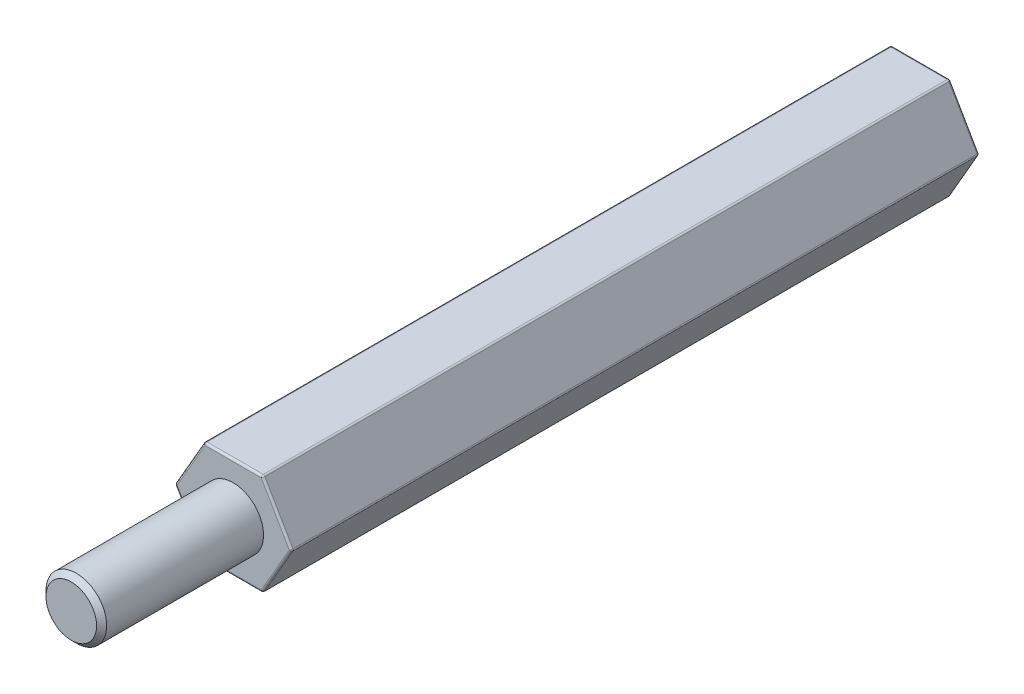
ISO-10303-21;
HEADER;
FILE_DESCRIPTION(('STEP AP214'),'2;1');
FILE_NAME('part.step','',(''),(''),'','','');
FILE_SCHEMA(('AUTOMOTIVE_DESIGN { 1 0 10303 214 1 1 1 1 }'));
ENDSEC;
DATA;
#1=APPLICATION_CONTEXT('core data for automotive mechanical design processes');
#2=APPLICATION_PROTOCOL_DEFINITION('international standard','automotive_design',2000,#1);
#3=PRODUCT_CONTEXT('',#1,'mechanical');
#4=PRODUCT('Part','Part','',(#3));
#5=PRODUCT_RELATED_PRODUCT_CATEGORY('part','',(#4));
#6=PRODUCT_DEFINITION_FORMATION('','',#4);
#7=PRODUCT_DEFINITION_CONTEXT('part definition',#1,'design');
#8=PRODUCT_DEFINITION('design','',#6,#7);
#9=PRODUCT_DEFINITION_SHAPE('','',#8);
#10=(LENGTH_UNIT() NAMED_UNIT(*) SI_UNIT(.MILLI.,.METRE.));
#11=(NAMED_UNIT(*) PLANE_ANGLE_UNIT() SI_UNIT($,.RADIAN.));
#12=(NAMED_UNIT(*) SI_UNIT($,.STERADIAN.) SOLID_ANGLE_UNIT());
#13=UNCERTAINTY_MEASURE_WITH_UNIT(LENGTH_MEASURE(1.E-05),#10,'distance_accuracy_value','');
#14=(GEOMETRIC_REPRESENTATION_CONTEXT(3) GLOBAL_UNCERTAINTY_ASSIGNED_CONTEXT((#13)) GLOBAL_UNIT_ASSIGNED_CONTEXT((#10,
#11,#12)) REPRESENTATION_CONTEXT('',''));
#15=CARTESIAN_POINT('',(0.,0.,0.));
#16=DIRECTION('',(0.,0.,1.));
#17=DIRECTION('',(1.,0.,0.));
#18=AXIS2_PLACEMENT_3D('',#15,#16,#17);
#19=CARTESIAN_POINT('',(0.,0.,8.));
#20=DIRECTION('',(0.,0.,-1.));
#21=DIRECTION('',(-1.,0.,0.));
#22=AXIS2_PLACEMENT_3D('',#19,#20,#21);
#23=CYLINDRICAL_SURFACE('',#22,1.5);
#24=CARTESIAN_POINT('',(0.,0.,7.75));
#25=DIRECTION('',(0.,0.,1.));
#26=DIRECTION('',(1.,0.,0.));
#27=AXIS2_PLACEMENT_3D('',#24,#25,#26);
#28=CIRCLE('',#27,1.5);
#29=CARTESIAN_POINT('',(1.5,0.,7.75));
#30=VERTEX_POINT('',#29);
#31=EDGE_CURVE('E189',#30,#30,#28,.F.);
#32=ORIENTED_EDGE('',*,*,#31,.T.);
#33=EDGE_LOOP('',(#32));
#34=FACE_BOUND('',#33,.T.);
#35=CARTESIAN_POINT('',(0.,0.,0.));
#36=DIRECTION('',(0.,0.,-1.));
#37=DIRECTION('',(-1.,0.,0.));
#38=AXIS2_PLACEMENT_3D('',#35,#36,#37);
#39=CIRCLE('',#38,1.5);
#40=CARTESIAN_POINT('',(-1.5,0.,0.));
#41=VERTEX_POINT('',#40);
#42=EDGE_CURVE('E173',#41,#41,#39,.T.);
#43=ORIENTED_EDGE('',*,*,#42,.F.);
#44=EDGE_LOOP('',(#43));
#45=FACE_BOUND('',#44,.T.);
#46=ADVANCED_FACE('F37',(#34,#45),#23,.T.);
#47=CARTESIAN_POINT('',(0.,0.,8.));
#48=DIRECTION('',(0.,0.,1.));
#49=DIRECTION('',(1.,0.,0.));
#50=AXIS2_PLACEMENT_3D('',#47,#48,#49);
#51=PLANE('',#50);
#52=CARTESIAN_POINT('',(0.,0.,8.));
#53=DIRECTION('',(0.,0.,1.));
#54=DIRECTION('',(1.,0.,0.));
#55=AXIS2_PLACEMENT_3D('',#52,#53,#54);
#56=CIRCLE('',#55,1.25);
#57=CARTESIAN_POINT('',(1.25,0.,8.));
#58=VERTEX_POINT('',#57);
#59=EDGE_CURVE('E186',#58,#58,#56,.T.);
#60=ORIENTED_EDGE('',*,*,#59,.T.);
#61=EDGE_LOOP('',(#60));
#62=FACE_BOUND('',#61,.T.);
#63=ADVANCED_FACE('F477',(#62),#51,.T.);
#64=CARTESIAN_POINT('',(-2.88675134594813,0.,0.));
#65=DIRECTION('',(0.,0.,-1.));
#66=DIRECTION('',(-1.,0.,0.));
#67=AXIS2_PLACEMENT_3D('',#64,#65,#66);
#68=PLANE('',#67);
#69=DIRECTION('',(0.5,-0.866025403784439,0.));
#70=VECTOR('',#69,1.);
#71=CARTESIAN_POINT('',(1.35677313259562,2.45,0.));
#72=LINE('',#71,#70);
#73=CARTESIAN_POINT('',(2.77128129211021,0.,0.));
#74=VERTEX_POINT('',#73);
#75=CARTESIAN_POINT('',(1.3856406460551,2.4,0.));
#76=VERTEX_POINT('',#75);
#77=EDGE_CURVE('E214',#74,#76,#72,.F.);
#78=ORIENTED_EDGE('',*,*,#77,.T.);
#79=DIRECTION('',(1.,0.,0.));
#80=VECTOR('',#79,1.);
#81=CARTESIAN_POINT('',(-2.88675134594813,2.4,0.));
#82=LINE('',#81,#80);
#83=CARTESIAN_POINT('',(-1.3856406460551,2.4,0.));
#84=VERTEX_POINT('',#83);
#85=EDGE_CURVE('E224',#76,#84,#82,.F.);
#86=ORIENTED_EDGE('',*,*,#85,.T.);
#87=DIRECTION('',(0.5,0.866025403784439,0.));
#88=VECTOR('',#87,1.);
#89=CARTESIAN_POINT('',(-2.80014880556968,-0.0499999999999989,0.));
#90=LINE('',#89,#88);
#91=CARTESIAN_POINT('',(-2.7712812921102,0.,0.));
#92=VERTEX_POINT('',#91);
#93=EDGE_CURVE('E222',#84,#92,#90,.F.);
#94=ORIENTED_EDGE('',*,*,#93,.T.);
#95=DIRECTION('',(-0.5,0.866025403784439,0.));
#96=VECTOR('',#95,1.);
#97=CARTESIAN_POINT('',(-2.80014880556968,0.0500000000000006,0.));
#98=LINE('',#97,#96);
#99=CARTESIAN_POINT('',(-1.3856406460551,-2.4,0.));
#100=VERTEX_POINT('',#99);
#101=EDGE_CURVE('E220',#92,#100,#98,.F.);
#102=ORIENTED_EDGE('',*,*,#101,.T.);
#103=DIRECTION('',(-1.,0.,0.));
#104=VECTOR('',#103,1.);
#105=CARTESIAN_POINT('',(-2.88675134594813,-2.4,0.));
#106=LINE('',#105,#104);
#107=CARTESIAN_POINT('',(1.3856406460551,-2.4,0.));
#108=VERTEX_POINT('',#107);
#109=EDGE_CURVE('E218',#100,#108,#106,.F.);
#110=ORIENTED_EDGE('',*,*,#109,.T.);
#111=DIRECTION('',(-0.5,-0.866025403784439,0.));
#112=VECTOR('',#111,1.);
#113=CARTESIAN_POINT('',(1.35677313259562,-2.45,0.));
#114=LINE('',#113,#112);
#115=EDGE_CURVE('E216',#108,#74,#114,.F.);
#116=ORIENTED_EDGE('',*,*,#115,.T.);
#117=EDGE_LOOP('',(#78,#86,#94,#102,#110,#116));
#118=FACE_BOUND('',#117,.T.);
#119=ORIENTED_EDGE('',*,*,#42,.T.);
#120=EDGE_LOOP('',(#119));
#121=FACE_BOUND('',#120,.T.);
#122=ADVANCED_FACE('F386',(#118,#121),#68,.F.);
#123=CARTESIAN_POINT('',(-1.44337567297406,-2.5,-34.));
#124=DIRECTION('',(0.866025403784439,0.5,0.));
#125=DIRECTION('',(-0.5,0.866025403784439,0.));
#126=AXIS2_PLACEMENT_3D('',#123,#124,#125);
#127=PLANE('',#126);
#128=DIRECTION('',(0.,0.,1.));
#129=VECTOR('',#128,1.);
#130=CARTESIAN_POINT('',(-2.85788383248865,-0.0499999999999997,-34.));
#131=LINE('',#130,#129);
#132=CARTESIAN_POINT('',(-2.85788383248865,-0.0499999999999995,-0.100000000000003));
#133=VERTEX_POINT('',#132);
#134=CARTESIAN_POINT('',(-2.85788383248865,-0.0499999999999995,-33.9));
#135=VERTEX_POINT('',#134);
#136=EDGE_CURVE('E240',#133,#135,#131,.F.);
#137=ORIENTED_EDGE('',*,*,#136,.T.);
#138=DIRECTION('',(-0.5,0.866025403784439,0.));
#139=VECTOR('',#138,1.);
#140=CARTESIAN_POINT('',(-1.44337567297406,-2.5,-33.9));
#141=LINE('',#140,#139);
#142=CARTESIAN_POINT('',(-1.47224318643355,-2.45,-33.9));
#143=VERTEX_POINT('',#142);
#144=EDGE_CURVE('E242',#135,#143,#141,.F.);
#145=ORIENTED_EDGE('',*,*,#144,.T.);
#146=DIRECTION('',(0.,0.,1.));
#147=VECTOR('',#146,1.);
#148=CARTESIAN_POINT('',(-1.47224318643355,-2.45,-34.));
#149=LINE('',#148,#147);
#150=CARTESIAN_POINT('',(-1.47224318643355,-2.45,-0.100000000000003));
#151=VERTEX_POINT('',#150);
#152=EDGE_CURVE('E236',#143,#151,#149,.T.);
#153=ORIENTED_EDGE('',*,*,#152,.T.);
#154=DIRECTION('',(-0.5,0.866025403784439,0.));
#155=VECTOR('',#154,1.);
#156=CARTESIAN_POINT('',(-1.44337567297406,-2.5,-0.100000000000003));
#157=LINE('',#156,#155);
#158=EDGE_CURVE('E238',#151,#133,#157,.T.);
#159=ORIENTED_EDGE('',*,*,#158,.T.);
#160=EDGE_LOOP('',(#137,#145,#153,#159));
#161=FACE_BOUND('',#160,.T.);
#162=ADVANCED_FACE('F403',(#161),#127,.F.);
#163=CARTESIAN_POINT('',(-2.88675134594813,0.,-34.));
#164=DIRECTION('',(0.866025403784439,-0.5,0.));
#165=DIRECTION('',(0.5,0.866025403784439,0.));
#166=AXIS2_PLACEMENT_3D('',#163,#164,#165);
#167=PLANE('',#166);
#168=DIRECTION('',(0.,0.,1.));
#169=VECTOR('',#168,1.);
#170=CARTESIAN_POINT('',(-1.47224318643354,2.45,-34.));
#171=LINE('',#170,#169);
#172=CARTESIAN_POINT('',(-1.47224318643354,2.45,-0.100000000000003));
#173=VERTEX_POINT('',#172);
#174=CARTESIAN_POINT('',(-1.47224318643354,2.45,-33.9));
#175=VERTEX_POINT('',#174);
#176=EDGE_CURVE('E231',#173,#175,#171,.F.);
#177=ORIENTED_EDGE('',*,*,#176,.T.);
#178=DIRECTION('',(0.5,0.866025403784439,0.));
#179=VECTOR('',#178,1.);
#180=CARTESIAN_POINT('',(-2.88675134594813,0.,-33.9));
#181=LINE('',#180,#179);
#182=CARTESIAN_POINT('',(-2.85788383248865,0.0500000000000008,-33.9));
#183=VERTEX_POINT('',#182);
#184=EDGE_CURVE('E233',#175,#183,#181,.F.);
#185=ORIENTED_EDGE('',*,*,#184,.T.);
#186=DIRECTION('',(0.,0.,1.));
#187=VECTOR('',#186,1.);
#188=CARTESIAN_POINT('',(-2.85788383248865,0.0500000000000008,-34.));
#189=LINE('',#188,#187);
#190=CARTESIAN_POINT('',(-2.85788383248865,0.0500000000000008,-0.100000000000003));
#191=VERTEX_POINT('',#190);
#192=EDGE_CURVE('E227',#183,#191,#189,.T.);
#193=ORIENTED_EDGE('',*,*,#192,.T.);
#194=DIRECTION('',(0.5,0.866025403784439,0.));
#195=VECTOR('',#194,1.);
#196=CARTESIAN_POINT('',(-2.88675134594813,0.,-0.100000000000003));
#197=LINE('',#196,#195);
#198=EDGE_CURVE('E229',#191,#173,#197,.T.);
#199=ORIENTED_EDGE('',*,*,#198,.T.);
#200=EDGE_LOOP('',(#177,#185,#193,#199));
#201=FACE_BOUND('',#200,.T.);
#202=ADVANCED_FACE('F796',(#201),#167,.F.);
#203=CARTESIAN_POINT('',(-1.44337567297406,2.5,-34.));
#204=DIRECTION('',(0.,-1.,0.));
#205=DIRECTION('',(0.,0.,-1.));
#206=AXIS2_PLACEMENT_3D('',#203,#204,#205);
#207=PLANE('',#206);
#208=DIRECTION('',(1.,0.,0.));
#209=VECTOR('',#208,1.);
#210=CARTESIAN_POINT('',(-1.44337567297406,2.5,-33.9));
#211=LINE('',#210,#209);
#212=CARTESIAN_POINT('',(1.3856406460551,2.5,-33.9));
#213=VERTEX_POINT('',#212);
#214=CARTESIAN_POINT('',(-1.3856406460551,2.5,-33.9));
#215=VERTEX_POINT('',#214);
#216=EDGE_CURVE('E209',#213,#215,#211,.F.);
#217=ORIENTED_EDGE('',*,*,#216,.T.);
#218=DIRECTION('',(0.,0.,1.));
#219=VECTOR('',#218,1.);
#220=CARTESIAN_POINT('',(-1.3856406460551,2.5,-34.));
#221=LINE('',#220,#219);
#222=CARTESIAN_POINT('',(-1.3856406460551,2.5,-0.100000000000003));
#223=VERTEX_POINT('',#222);
#224=EDGE_CURVE('E212',#215,#223,#221,.T.);
#225=ORIENTED_EDGE('',*,*,#224,.T.);
#226=DIRECTION('',(1.,0.,0.));
#227=VECTOR('',#226,1.);
#228=CARTESIAN_POINT('',(-1.44337567297406,2.5,-0.100000000000003));
#229=LINE('',#228,#227);
#230=CARTESIAN_POINT('',(1.3856406460551,2.5,-0.100000000000003));
#231=VERTEX_POINT('',#230);
#232=EDGE_CURVE('E207',#223,#231,#229,.T.);
#233=ORIENTED_EDGE('',*,*,#232,.T.);
#234=DIRECTION('',(0.,0.,1.));
#235=VECTOR('',#234,1.);
#236=CARTESIAN_POINT('',(1.3856406460551,2.5,-34.));
#237=LINE('',#236,#235);
#238=EDGE_CURVE('E205',#231,#213,#237,.F.);
#239=ORIENTED_EDGE('',*,*,#238,.T.);
#240=EDGE_LOOP('',(#217,#225,#233,#239));
#241=FACE_BOUND('',#240,.T.);
#242=ADVANCED_FACE('F787',(#241),#207,.F.);
#243=CARTESIAN_POINT('',(1.44337567297407,2.5,-34.));
#244=DIRECTION('',(-0.866025403784439,-0.5,0.));
#245=DIRECTION('',(0.5,-0.866025403784439,0.));
#246=AXIS2_PLACEMENT_3D('',#243,#244,#245);
#247=PLANE('',#246);
#248=DIRECTION('',(0.5,-0.866025403784439,0.));
#249=VECTOR('',#248,1.);
#250=CARTESIAN_POINT('',(1.44337567297407,2.5,-33.9));
#251=LINE('',#250,#249);
#252=CARTESIAN_POINT('',(2.85788383248865,0.0500000000000002,-33.9));
#253=VERTEX_POINT('',#252);
#254=CARTESIAN_POINT('',(1.47224318643355,2.45,-33.9));
#255=VERTEX_POINT('',#254);
#256=EDGE_CURVE('E46',#253,#255,#251,.F.);
#257=ORIENTED_EDGE('',*,*,#256,.T.);
#258=DIRECTION('',(0.,0.,1.));
#259=VECTOR('',#258,1.);
#260=CARTESIAN_POINT('',(1.47224318643355,2.45,-34.));
#261=LINE('',#260,#259);
#262=CARTESIAN_POINT('',(1.47224318643355,2.45,-0.100000000000003));
#263=VERTEX_POINT('',#262);
#264=EDGE_CURVE('E11',#255,#263,#261,.T.);
#265=ORIENTED_EDGE('',*,*,#264,.T.);
#266=DIRECTION('',(0.5,-0.866025403784439,0.));
#267=VECTOR('',#266,1.);
#268=CARTESIAN_POINT('',(1.44337567297407,2.5,-0.100000000000003));
#269=LINE('',#268,#267);
#270=CARTESIAN_POINT('',(2.85788383248865,0.0500000000000002,-0.100000000000003));
#271=VERTEX_POINT('',#270);
#272=EDGE_CURVE('E263',#263,#271,#269,.T.);
#273=ORIENTED_EDGE('',*,*,#272,.T.);
#274=DIRECTION('',(0.,0.,1.));
#275=VECTOR('',#274,1.);
#276=CARTESIAN_POINT('',(2.85788383248865,0.0500000000000001,-34.));
#277=LINE('',#276,#275);
#278=EDGE_CURVE('E57',#271,#253,#277,.F.);
#279=ORIENTED_EDGE('',*,*,#278,.T.);
#280=EDGE_LOOP('',(#257,#265,#273,#279));
#281=FACE_BOUND('',#280,.T.);
#282=ADVANCED_FACE('F778',(#281),#247,.F.);
#283=CARTESIAN_POINT('',(2.88675134594813,0.,-34.));
#284=DIRECTION('',(-0.866025403784439,0.5,0.));
#285=DIRECTION('',(-0.5,-0.866025403784439,0.));
#286=AXIS2_PLACEMENT_3D('',#283,#284,#285);
#287=PLANE('',#286);
#288=DIRECTION('',(0.,0.,1.));
#289=VECTOR('',#288,1.);
#290=CARTESIAN_POINT('',(1.47224318643355,-2.45,-34.));
#291=LINE('',#290,#289);
#292=CARTESIAN_POINT('',(1.47224318643355,-2.45,-0.100000000000003));
#293=VERTEX_POINT('',#292);
#294=CARTESIAN_POINT('',(1.47224318643355,-2.45,-33.9));
#295=VERTEX_POINT('',#294);
#296=EDGE_CURVE('E258',#293,#295,#291,.F.);
#297=ORIENTED_EDGE('',*,*,#296,.T.);
#298=DIRECTION('',(-0.5,-0.866025403784439,0.));
#299=VECTOR('',#298,1.);
#300=CARTESIAN_POINT('',(2.88675134594813,0.,-33.9));
#301=LINE('',#300,#299);
#302=CARTESIAN_POINT('',(2.85788383248865,-0.05,-33.9));
#303=VERTEX_POINT('',#302);
#304=EDGE_CURVE('E260',#295,#303,#301,.F.);
#305=ORIENTED_EDGE('',*,*,#304,.T.);
#306=DIRECTION('',(0.,0.,1.));
#307=VECTOR('',#306,1.);
#308=CARTESIAN_POINT('',(2.85788383248865,-0.05,-34.));
#309=LINE('',#308,#307);
#310=CARTESIAN_POINT('',(2.85788383248865,-0.05,-0.100000000000003));
#311=VERTEX_POINT('',#310);
#312=EDGE_CURVE('E254',#303,#311,#309,.T.);
#313=ORIENTED_EDGE('',*,*,#312,.T.);
#314=DIRECTION('',(-0.5,-0.866025403784439,0.));
#315=VECTOR('',#314,1.);
#316=CARTESIAN_POINT('',(2.88675134594813,0.,-0.100000000000003));
#317=LINE('',#316,#315);
#318=EDGE_CURVE('E256',#311,#293,#317,.T.);
#319=ORIENTED_EDGE('',*,*,#318,.T.);
#320=EDGE_LOOP('',(#297,#305,#313,#319));
#321=FACE_BOUND('',#320,.T.);
#322=ADVANCED_FACE('F377',(#321),#287,.F.);
#323=CARTESIAN_POINT('',(1.44337567297407,-2.5,-34.));
#324=DIRECTION('',(0.,1.,0.));
#325=DIRECTION('',(-1.,0.,0.));
#326=AXIS2_PLACEMENT_3D('',#323,#324,#325);
#327=PLANE('',#326);
#328=DIRECTION('',(0.,0.,1.));
#329=VECTOR('',#328,1.);
#330=CARTESIAN_POINT('',(-1.3856406460551,-2.5,-34.));
#331=LINE('',#330,#329);
#332=CARTESIAN_POINT('',(-1.3856406460551,-2.5,-0.100000000000003));
#333=VERTEX_POINT('',#332);
#334=CARTESIAN_POINT('',(-1.3856406460551,-2.5,-33.9));
#335=VERTEX_POINT('',#334);
#336=EDGE_CURVE('E249',#333,#335,#331,.F.);
#337=ORIENTED_EDGE('',*,*,#336,.T.);
#338=DIRECTION('',(-1.,0.,0.));
#339=VECTOR('',#338,1.);
#340=CARTESIAN_POINT('',(1.44337567297407,-2.5,-33.9));
#341=LINE('',#340,#339);
#342=CARTESIAN_POINT('',(1.3856406460551,-2.5,-33.9));
#343=VERTEX_POINT('',#342);
#344=EDGE_CURVE('E251',#335,#343,#341,.F.);
#345=ORIENTED_EDGE('',*,*,#344,.T.);
#346=DIRECTION('',(0.,0.,1.));
#347=VECTOR('',#346,1.);
#348=CARTESIAN_POINT('',(1.3856406460551,-2.5,-34.));
#349=LINE('',#348,#347);
#350=CARTESIAN_POINT('',(1.3856406460551,-2.5,-0.100000000000003));
#351=VERTEX_POINT('',#350);
#352=EDGE_CURVE('E245',#343,#351,#349,.T.);
#353=ORIENTED_EDGE('',*,*,#352,.T.);
#354=DIRECTION('',(-1.,0.,0.));
#355=VECTOR('',#354,1.);
#356=CARTESIAN_POINT('',(1.44337567297407,-2.5,-0.100000000000003));
#357=LINE('',#356,#355);
#358=EDGE_CURVE('E247',#351,#333,#357,.T.);
#359=ORIENTED_EDGE('',*,*,#358,.T.);
#360=EDGE_LOOP('',(#337,#345,#353,#359));
#361=FACE_BOUND('',#360,.T.);
#362=ADVANCED_FACE('F412',(#361),#327,.F.);
#363=CARTESIAN_POINT('',(-2.88675134594813,0.,-34.));
#364=DIRECTION('',(0.,0.,-1.));
#365=DIRECTION('',(-1.,0.,0.));
#366=AXIS2_PLACEMENT_3D('',#363,#364,#365);
#367=PLANE('',#366);
#368=DIRECTION('',(0.5,0.866025403784439,0.));
#369=VECTOR('',#368,1.);
#370=CARTESIAN_POINT('',(-1.35677313259562,2.45,-34.));
#371=LINE('',#370,#369);
#372=CARTESIAN_POINT('',(-2.7712812921102,0.,-34.));
#373=VERTEX_POINT('',#372);
#374=CARTESIAN_POINT('',(-1.3856406460551,2.4,-34.));
#375=VERTEX_POINT('',#374);
#376=EDGE_CURVE('E200',#373,#375,#371,.T.);
#377=ORIENTED_EDGE('',*,*,#376,.T.);
#378=DIRECTION('',(1.,0.,0.));
#379=VECTOR('',#378,1.);
#380=CARTESIAN_POINT('',(1.44337567297407,2.4,-34.));
#381=LINE('',#380,#379);
#382=CARTESIAN_POINT('',(1.3856406460551,2.4,-34.));
#383=VERTEX_POINT('',#382);
#384=EDGE_CURVE('E202',#375,#383,#381,.T.);
#385=ORIENTED_EDGE('',*,*,#384,.T.);
#386=DIRECTION('',(0.5,-0.866025403784439,0.));
#387=VECTOR('',#386,1.);
#388=CARTESIAN_POINT('',(2.80014880556969,-0.0500000000000001,-34.));
#389=LINE('',#388,#387);
#390=CARTESIAN_POINT('',(2.77128129211021,0.,-34.));
#391=VERTEX_POINT('',#390);
#392=EDGE_CURVE('E192',#383,#391,#389,.T.);
#393=ORIENTED_EDGE('',*,*,#392,.T.);
#394=DIRECTION('',(-0.5,-0.866025403784439,0.));
#395=VECTOR('',#394,1.);
#396=CARTESIAN_POINT('',(1.35677313259562,-2.45,-34.));
#397=LINE('',#396,#395);
#398=CARTESIAN_POINT('',(1.3856406460551,-2.4,-34.));
#399=VERTEX_POINT('',#398);
#400=EDGE_CURVE('E194',#391,#399,#397,.T.);
#401=ORIENTED_EDGE('',*,*,#400,.T.);
#402=DIRECTION('',(-1.,0.,0.));
#403=VECTOR('',#402,1.);
#404=CARTESIAN_POINT('',(-1.44337567297406,-2.4,-34.));
#405=LINE('',#404,#403);
#406=CARTESIAN_POINT('',(-1.3856406460551,-2.4,-34.));
#407=VERTEX_POINT('',#406);
#408=EDGE_CURVE('E196',#399,#407,#405,.T.);
#409=ORIENTED_EDGE('',*,*,#408,.T.);
#410=DIRECTION('',(-0.5,0.866025403784439,0.));
#411=VECTOR('',#410,1.);
#412=CARTESIAN_POINT('',(-2.80014880556968,0.0500000000000006,-34.));
#413=LINE('',#412,#411);
#414=EDGE_CURVE('E198',#407,#373,#413,.T.);
#415=ORIENTED_EDGE('',*,*,#414,.T.);
#416=EDGE_LOOP('',(#377,#385,#393,#401,#409,#415));
#417=FACE_BOUND('',#416,.T.);
#418=CARTESIAN_POINT('',(0.,0.,-34.));
#419=DIRECTION('',(0.,0.,-1.));
#420=DIRECTION('',(-1.,0.,0.));
#421=AXIS2_PLACEMENT_3D('',#418,#419,#420);
#422=CIRCLE('',#421,1.5);
#423=CARTESIAN_POINT('',(-1.5,0.,-34.));
#424=VERTEX_POINT('',#423);
#425=EDGE_CURVE('E183',#424,#424,#422,.F.);
#426=ORIENTED_EDGE('',*,*,#425,.T.);
#427=EDGE_LOOP('',(#426));
#428=FACE_BOUND('',#427,.T.);
#429=ADVANCED_FACE('F167',(#417,#428),#367,.T.);
#430=CARTESIAN_POINT('',(0.,0.,-29.7));
#431=DIRECTION('',(0.,0.,-1.));
#432=DIRECTION('',(-1.,0.,0.));
#433=AXIS2_PLACEMENT_3D('',#430,#431,#432);
#434=CONICAL_SURFACE('',#433,1.25,1.02974425867665);
#435=CARTESIAN_POINT('',(0.,0.,-28.9489242262156));
#436=VERTEX_POINT('',#435);
#437=VERTEX_LOOP('',#436);
#438=FACE_BOUND('',#437,.T.);
#439=CARTESIAN_POINT('',(0.,0.,-29.7));
#440=DIRECTION('',(0.,0.,-1.));
#441=DIRECTION('',(-1.,0.,0.));
#442=AXIS2_PLACEMENT_3D('',#439,#440,#441);
#443=CIRCLE('',#442,1.25);
#444=CARTESIAN_POINT('',(-1.25,0.,-29.7));
#445=VERTEX_POINT('',#444);
#446=EDGE_CURVE('E171',#445,#445,#443,.T.);
#447=ORIENTED_EDGE('',*,*,#446,.T.);
#448=EDGE_LOOP('',(#447));
#449=FACE_BOUND('',#448,.T.);
#450=ADVANCED_FACE('F163',(#438,#449),#434,.F.);
#451=CARTESIAN_POINT('',(0.,0.,-34.));
#452=DIRECTION('',(0.,0.,-1.));
#453=DIRECTION('',(-1.,0.,0.));
#454=AXIS2_PLACEMENT_3D('',#451,#452,#453);
#455=CYLINDRICAL_SURFACE('',#454,1.25);
#456=CARTESIAN_POINT('',(0.,0.,-33.75));
#457=DIRECTION('',(0.,0.,-1.));
#458=DIRECTION('',(-1.,0.,0.));
#459=AXIS2_PLACEMENT_3D('',#456,#457,#458);
#460=CIRCLE('',#459,1.25);
#461=CARTESIAN_POINT('',(-1.25,0.,-33.75));
#462=VERTEX_POINT('',#461);
#463=EDGE_CURVE('E176',#462,#462,#460,.T.);
#464=ORIENTED_EDGE('',*,*,#463,.T.);
#465=EDGE_LOOP('',(#464));
#466=FACE_BOUND('',#465,.T.);
#467=ORIENTED_EDGE('',*,*,#446,.F.);
#468=EDGE_LOOP('',(#467));
#469=FACE_BOUND('',#468,.T.);
#470=ADVANCED_FACE('F166',(#466,#469),#455,.F.);
#471=CARTESIAN_POINT('',(0.,0.,-33.75));
#472=DIRECTION('',(0.,0.,-1.));
#473=DIRECTION('',(-1.,0.,0.));
#474=AXIS2_PLACEMENT_3D('',#471,#472,#473);
#475=CONICAL_SURFACE('',#474,1.25,0.785398163397445);
#476=ORIENTED_EDGE('',*,*,#425,.F.);
#477=EDGE_LOOP('',(#476));
#478=FACE_BOUND('',#477,.T.);
#479=ORIENTED_EDGE('',*,*,#463,.F.);
#480=EDGE_LOOP('',(#479));
#481=FACE_BOUND('',#480,.T.);
#482=ADVANCED_FACE('F488',(#478,#481),#475,.F.);
#483=CARTESIAN_POINT('',(0.,0.,8.));
#484=DIRECTION('',(0.,0.,-1.));
#485=DIRECTION('',(-1.,0.,0.));
#486=AXIS2_PLACEMENT_3D('',#483,#484,#485);
#487=CONICAL_SURFACE('',#486,1.25,0.785398163397438);
#488=ORIENTED_EDGE('',*,*,#31,.F.);
#489=EDGE_LOOP('',(#488));
#490=FACE_BOUND('',#489,.T.);
#491=ORIENTED_EDGE('',*,*,#59,.F.);
#492=EDGE_LOOP('',(#491));
#493=FACE_BOUND('',#492,.T.);
#494=ADVANCED_FACE('F491',(#490,#493),#487,.T.);
#495=CARTESIAN_POINT('',(1.44337567297407,-2.4,-0.100000000000003));
#496=DIRECTION('',(-1.,0.,0.));
#497=DIRECTION('',(0.,-1.,0.));
#498=AXIS2_PLACEMENT_3D('',#495,#496,#497);
#499=CYLINDRICAL_SURFACE('',#498,0.1);
#500=CARTESIAN_POINT('',(-1.3856406460551,-2.4,-0.100000000000003));
#501=DIRECTION('',(-1.,0.,0.));
#502=DIRECTION('',(0.,0.,1.));
#503=AXIS2_PLACEMENT_3D('',#500,#501,#502);
#504=CIRCLE('',#503,0.1);
#505=EDGE_CURVE('E41',#333,#100,#504,.T.);
#506=ORIENTED_EDGE('',*,*,#505,.F.);
#507=ORIENTED_EDGE('',*,*,#358,.F.);
#508=CARTESIAN_POINT('',(1.3856406460551,-2.4,-0.1));
#509=DIRECTION('',(1.,0.,0.));
#510=DIRECTION('',(0.,1.,0.));
#511=AXIS2_PLACEMENT_3D('',#508,#509,#510);
#512=CIRCLE('',#511,0.1);
#513=EDGE_CURVE('E179',#108,#351,#512,.T.);
#514=ORIENTED_EDGE('',*,*,#513,.F.);
#515=ORIENTED_EDGE('',*,*,#109,.F.);
#516=EDGE_LOOP('',(#506,#507,#514,#515));
#517=FACE_BOUND('',#516,.T.);
#518=ADVANCED_FACE('F39',(#517),#499,.T.);
#519=CARTESIAN_POINT('',(-1.3856406460551,-2.4,-0.1));
#520=DIRECTION('',(0.,0.,1.));
#521=DIRECTION('',(1.,0.,0.));
#522=AXIS2_PLACEMENT_3D('',#519,#520,#521);
#523=SPHERICAL_SURFACE('',#522,0.1);
#524=CARTESIAN_POINT('',(-1.3856406460551,-2.4,-0.100000000000003));
#525=DIRECTION('',(0.,0.,1.));
#526=DIRECTION('',(1.,0.,0.));
#527=AXIS2_PLACEMENT_3D('',#524,#525,#526);
#528=CIRCLE('',#527,0.1);
#529=EDGE_CURVE('E355',#333,#151,#528,.F.);
#530=ORIENTED_EDGE('',*,*,#529,.F.);
#531=ORIENTED_EDGE('',*,*,#505,.T.);
#532=CARTESIAN_POINT('',(-1.3856406460551,-2.4,-0.1));
#533=DIRECTION('',(0.5,-0.866025403784439,0.));
#534=DIRECTION('',(0.866025403784439,0.5,0.));
#535=AXIS2_PLACEMENT_3D('',#532,#533,#534);
#536=CIRCLE('',#535,0.1);
#537=EDGE_CURVE('E358',#151,#100,#536,.F.);
#538=ORIENTED_EDGE('',*,*,#537,.F.);
#539=EDGE_LOOP('',(#530,#531,#538));
#540=FACE_BOUND('',#539,.T.);
#541=ADVANCED_FACE('F395',(#540),#523,.T.);
#542=CARTESIAN_POINT('',(1.3856406460551,-2.4,-0.1));
#543=DIRECTION('',(0.,0.,1.));
#544=DIRECTION('',(1.,0.,0.));
#545=AXIS2_PLACEMENT_3D('',#542,#543,#544);
#546=SPHERICAL_SURFACE('',#545,0.1);
#547=CARTESIAN_POINT('',(1.3856406460551,-2.4,-0.100000000000003));
#548=DIRECTION('',(-0.500000000000001,-0.866025403784438,0.));
#549=DIRECTION('',(0.866025403784438,-0.500000000000001,0.));
#550=AXIS2_PLACEMENT_3D('',#547,#548,#549);
#551=CIRCLE('',#550,0.1);
#552=EDGE_CURVE('E349',#108,#293,#551,.F.);
#553=ORIENTED_EDGE('',*,*,#552,.F.);
#554=ORIENTED_EDGE('',*,*,#513,.T.);
#555=CARTESIAN_POINT('',(1.3856406460551,-2.4,-0.100000000000003));
#556=DIRECTION('',(0.,0.,1.));
#557=DIRECTION('',(1.,0.,0.));
#558=AXIS2_PLACEMENT_3D('',#555,#556,#557);
#559=CIRCLE('',#558,0.1);
#560=EDGE_CURVE('E352',#293,#351,#559,.F.);
#561=ORIENTED_EDGE('',*,*,#560,.F.);
#562=EDGE_LOOP('',(#553,#554,#561));
#563=FACE_BOUND('',#562,.T.);
#564=ADVANCED_FACE('F365',(#563),#546,.T.);
#565=CARTESIAN_POINT('',(-1.35677313259562,-2.45,-0.100000000000003));
#566=DIRECTION('',(-0.5,0.866025403784439,0.));
#567=DIRECTION('',(-0.866025403784439,-0.5,0.));
#568=AXIS2_PLACEMENT_3D('',#565,#566,#567);
#569=CYLINDRICAL_SURFACE('',#568,0.1);
#570=ORIENTED_EDGE('',*,*,#537,.T.);
#571=ORIENTED_EDGE('',*,*,#101,.F.);
#572=CARTESIAN_POINT('',(-2.7712812921102,0.,-0.100000000000003));
#573=DIRECTION('',(-0.500000000000001,0.866025403784438,0.));
#574=DIRECTION('',(-0.866025403784438,-0.500000000000001,0.));
#575=AXIS2_PLACEMENT_3D('',#572,#573,#574);
#576=CIRCLE('',#575,0.1);
#577=EDGE_CURVE('E346',#133,#92,#576,.T.);
#578=ORIENTED_EDGE('',*,*,#577,.F.);
#579=ORIENTED_EDGE('',*,*,#158,.F.);
#580=EDGE_LOOP('',(#570,#571,#578,#579));
#581=FACE_BOUND('',#580,.T.);
#582=ADVANCED_FACE('F399',(#581),#569,.T.);
#583=CARTESIAN_POINT('',(-1.3856406460551,-2.4,-34.));
#584=DIRECTION('',(0.,0.,1.));
#585=DIRECTION('',(1.,0.,0.));
#586=AXIS2_PLACEMENT_3D('',#583,#584,#585);
#587=CYLINDRICAL_SURFACE('',#586,0.1);
#588=ORIENTED_EDGE('',*,*,#529,.T.);
#589=ORIENTED_EDGE('',*,*,#152,.F.);
#590=CARTESIAN_POINT('',(-1.3856406460551,-2.4,-33.9));
#591=DIRECTION('',(0.,0.,-1.));
#592=DIRECTION('',(-1.,0.,0.));
#593=AXIS2_PLACEMENT_3D('',#590,#591,#592);
#594=CIRCLE('',#593,0.1);
#595=EDGE_CURVE('E343',#335,#143,#594,.T.);
#596=ORIENTED_EDGE('',*,*,#595,.F.);
#597=ORIENTED_EDGE('',*,*,#336,.F.);
#598=EDGE_LOOP('',(#588,#589,#596,#597));
#599=FACE_BOUND('',#598,.T.);
#600=ADVANCED_FACE('F409',(#599),#587,.T.);
#601=CARTESIAN_POINT('',(-2.88675134594813,-2.4,-33.9));
#602=DIRECTION('',(1.,0.,0.));
#603=DIRECTION('',(0.,1.,0.));
#604=AXIS2_PLACEMENT_3D('',#601,#602,#603);
#605=CYLINDRICAL_SURFACE('',#604,0.1);
#606=CARTESIAN_POINT('',(1.3856406460551,-2.4,-33.9));
#607=DIRECTION('',(1.,0.,0.));
#608=DIRECTION('',(0.,0.,-1.));
#609=AXIS2_PLACEMENT_3D('',#606,#607,#608);
#610=CIRCLE('',#609,0.1);
#611=EDGE_CURVE('E337',#343,#399,#610,.T.);
#612=ORIENTED_EDGE('',*,*,#611,.F.);
#613=ORIENTED_EDGE('',*,*,#344,.F.);
#614=CARTESIAN_POINT('',(-1.3856406460551,-2.4,-33.9));
#615=DIRECTION('',(-1.,0.,0.));
#616=DIRECTION('',(0.,-1.,0.));
#617=AXIS2_PLACEMENT_3D('',#614,#615,#616);
#618=CIRCLE('',#617,0.1);
#619=EDGE_CURVE('E340',#407,#335,#618,.T.);
#620=ORIENTED_EDGE('',*,*,#619,.F.);
#621=ORIENTED_EDGE('',*,*,#408,.F.);
#622=EDGE_LOOP('',(#612,#613,#620,#621));
#623=FACE_BOUND('',#622,.T.);
#624=ADVANCED_FACE('F416',(#623),#605,.T.);
#625=CARTESIAN_POINT('',(1.3856406460551,-2.4,-34.));
#626=DIRECTION('',(0.,0.,1.));
#627=DIRECTION('',(1.,0.,0.));
#628=AXIS2_PLACEMENT_3D('',#625,#626,#627);
#629=CYLINDRICAL_SURFACE('',#628,0.1);
#630=ORIENTED_EDGE('',*,*,#560,.T.);
#631=ORIENTED_EDGE('',*,*,#352,.F.);
#632=CARTESIAN_POINT('',(1.3856406460551,-2.4,-33.9));
#633=DIRECTION('',(0.,0.,-1.));
#634=DIRECTION('',(-1.,0.,0.));
#635=AXIS2_PLACEMENT_3D('',#632,#633,#634);
#636=CIRCLE('',#635,0.1);
#637=EDGE_CURVE('E335',#295,#343,#636,.T.);
#638=ORIENTED_EDGE('',*,*,#637,.F.);
#639=ORIENTED_EDGE('',*,*,#296,.F.);
#640=EDGE_LOOP('',(#630,#631,#638,#639));
#641=FACE_BOUND('',#640,.T.);
#642=ADVANCED_FACE('F373',(#641),#629,.T.);
#643=CARTESIAN_POINT('',(2.80014880556969,0.0500000000000004,-0.100000000000003));
#644=DIRECTION('',(-0.5,-0.866025403784439,0.));
#645=DIRECTION('',(0.866025403784439,-0.5,0.));
#646=AXIS2_PLACEMENT_3D('',#643,#644,#645);
#647=CYLINDRICAL_SURFACE('',#646,0.1);
#648=ORIENTED_EDGE('',*,*,#552,.T.);
#649=ORIENTED_EDGE('',*,*,#318,.F.);
#650=CARTESIAN_POINT('',(2.77128129211021,0.,-0.1));
#651=DIRECTION('',(0.500000000000001,0.866025403784438,0.));
#652=DIRECTION('',(-0.866025403784438,0.500000000000001,0.));
#653=AXIS2_PLACEMENT_3D('',#650,#651,#652);
#654=CIRCLE('',#653,0.1);
#655=EDGE_CURVE('E332',#74,#311,#654,.T.);
#656=ORIENTED_EDGE('',*,*,#655,.F.);
#657=ORIENTED_EDGE('',*,*,#115,.F.);
#658=EDGE_LOOP('',(#648,#649,#656,#657));
#659=FACE_BOUND('',#658,.T.);
#660=ADVANCED_FACE('F383',(#659),#647,.T.);
#661=CARTESIAN_POINT('',(-2.7712812921102,0.,-0.1));
#662=DIRECTION('',(0.,0.,1.));
#663=DIRECTION('',(1.,0.,0.));
#664=AXIS2_PLACEMENT_3D('',#661,#662,#663);
#665=SPHERICAL_SURFACE('',#664,0.1);
#666=CARTESIAN_POINT('',(-2.7712812921102,0.,-0.100000000000003));
#667=DIRECTION('',(0.,0.,1.));
#668=DIRECTION('',(1.,0.,0.));
#669=AXIS2_PLACEMENT_3D('',#666,#667,#668);
#670=CIRCLE('',#669,0.1);
#671=EDGE_CURVE('E326',#133,#191,#670,.F.);
#672=ORIENTED_EDGE('',*,*,#671,.F.);
#673=ORIENTED_EDGE('',*,*,#577,.T.);
#674=CARTESIAN_POINT('',(-2.7712812921102,0.,-0.1));
#675=DIRECTION('',(-0.500000000000006,-0.866025403784435,0.));
#676=DIRECTION('',(0.866025403784435,-0.500000000000006,0.));
#677=AXIS2_PLACEMENT_3D('',#674,#675,#676);
#678=CIRCLE('',#677,0.1);
#679=EDGE_CURVE('E329',#191,#92,#678,.F.);
#680=ORIENTED_EDGE('',*,*,#679,.F.);
#681=EDGE_LOOP('',(#672,#673,#680));
#682=FACE_BOUND('',#681,.T.);
#683=ADVANCED_FACE('F453',(#682),#665,.T.);
#684=CARTESIAN_POINT('',(-1.3856406460551,-2.4,-33.9));
#685=DIRECTION('',(0.,0.,1.));
#686=DIRECTION('',(1.,0.,0.));
#687=AXIS2_PLACEMENT_3D('',#684,#685,#686);
#688=SPHERICAL_SURFACE('',#687,0.1);
#689=ORIENTED_EDGE('',*,*,#619,.T.);
#690=ORIENTED_EDGE('',*,*,#595,.T.);
#691=CARTESIAN_POINT('',(-1.3856406460551,-2.4,-33.9));
#692=DIRECTION('',(0.500000000000001,-0.866025403784438,0.));
#693=DIRECTION('',(0.866025403784438,0.500000000000001,0.));
#694=AXIS2_PLACEMENT_3D('',#691,#692,#693);
#695=CIRCLE('',#694,0.1);
#696=EDGE_CURVE('E324',#407,#143,#695,.F.);
#697=ORIENTED_EDGE('',*,*,#696,.F.);
#698=EDGE_LOOP('',(#689,#690,#697));
#699=FACE_BOUND('',#698,.T.);
#700=ADVANCED_FACE('F467',(#699),#688,.T.);
#701=CARTESIAN_POINT('',(1.3856406460551,-2.4,-33.9));
#702=DIRECTION('',(0.,0.,1.));
#703=DIRECTION('',(1.,0.,0.));
#704=AXIS2_PLACEMENT_3D('',#701,#702,#703);
#705=SPHERICAL_SURFACE('',#704,0.1);
#706=ORIENTED_EDGE('',*,*,#637,.T.);
#707=ORIENTED_EDGE('',*,*,#611,.T.);
#708=CARTESIAN_POINT('',(1.3856406460551,-2.4,-33.9));
#709=DIRECTION('',(-0.499999999999995,-0.866025403784441,0.));
#710=DIRECTION('',(0.866025403784441,-0.499999999999995,0.));
#711=AXIS2_PLACEMENT_3D('',#708,#709,#710);
#712=CIRCLE('',#711,0.1);
#713=EDGE_CURVE('E321',#295,#399,#712,.F.);
#714=ORIENTED_EDGE('',*,*,#713,.F.);
#715=EDGE_LOOP('',(#706,#707,#714));
#716=FACE_BOUND('',#715,.T.);
#717=ADVANCED_FACE('F420',(#716),#705,.T.);
#718=CARTESIAN_POINT('',(2.77128129211021,0.,-0.1));
#719=DIRECTION('',(0.,0.,1.));
#720=DIRECTION('',(1.,0.,0.));
#721=AXIS2_PLACEMENT_3D('',#718,#719,#720);
#722=SPHERICAL_SURFACE('',#721,0.1);
#723=CARTESIAN_POINT('',(2.77128129211021,0.,-0.100000000000003));
#724=DIRECTION('',(0.500000000000001,-0.866025403784438,0.));
#725=DIRECTION('',(0.866025403784438,0.500000000000001,0.));
#726=AXIS2_PLACEMENT_3D('',#723,#724,#725);
#727=CIRCLE('',#726,0.1);
#728=EDGE_CURVE('E315',#74,#271,#727,.F.);
#729=ORIENTED_EDGE('',*,*,#728,.F.);
#730=ORIENTED_EDGE('',*,*,#655,.T.);
#731=CARTESIAN_POINT('',(2.77128129211021,0.,-0.100000000000003));
#732=DIRECTION('',(0.,0.,1.));
#733=DIRECTION('',(1.,0.,0.));
#734=AXIS2_PLACEMENT_3D('',#731,#732,#733);
#735=CIRCLE('',#734,0.1);
#736=EDGE_CURVE('E318',#271,#311,#735,.F.);
#737=ORIENTED_EDGE('',*,*,#736,.F.);
#738=EDGE_LOOP('',(#729,#730,#737));
#739=FACE_BOUND('',#738,.T.);
#740=ADVANCED_FACE('F431',(#739),#722,.T.);
#741=CARTESIAN_POINT('',(-2.80014880556968,-0.0499999999999996,-0.100000000000003));
#742=DIRECTION('',(0.5,0.866025403784439,0.));
#743=DIRECTION('',(-0.866025403784439,0.5,0.));
#744=AXIS2_PLACEMENT_3D('',#741,#742,#743);
#745=CYLINDRICAL_SURFACE('',#744,0.1);
#746=ORIENTED_EDGE('',*,*,#679,.T.);
#747=ORIENTED_EDGE('',*,*,#93,.F.);
#748=CARTESIAN_POINT('',(-1.3856406460551,2.4,-0.100000000000003));
#749=DIRECTION('',(0.500000000000001,0.866025403784438,0.));
#750=DIRECTION('',(-0.866025403784438,0.500000000000001,0.));
#751=AXIS2_PLACEMENT_3D('',#748,#749,#750);
#752=CIRCLE('',#751,0.1);
#753=EDGE_CURVE('E310',#173,#84,#752,.T.);
#754=ORIENTED_EDGE('',*,*,#753,.F.);
#755=ORIENTED_EDGE('',*,*,#198,.F.);
#756=EDGE_LOOP('',(#746,#747,#754,#755));
#757=FACE_BOUND('',#756,.T.);
#758=ADVANCED_FACE('F448',(#757),#745,.T.);
#759=CARTESIAN_POINT('',(-2.7712812921102,0.,-34.));
#760=DIRECTION('',(0.,0.,1.));
#761=DIRECTION('',(1.,0.,0.));
#762=AXIS2_PLACEMENT_3D('',#759,#760,#761);
#763=CYLINDRICAL_SURFACE('',#762,0.1);
#764=ORIENTED_EDGE('',*,*,#671,.T.);
#765=ORIENTED_EDGE('',*,*,#192,.F.);
#766=CARTESIAN_POINT('',(-2.7712812921102,0.,-33.9));
#767=DIRECTION('',(0.,0.,-1.));
#768=DIRECTION('',(-1.,0.,0.));
#769=AXIS2_PLACEMENT_3D('',#766,#767,#768);
#770=CIRCLE('',#769,0.1);
#771=EDGE_CURVE('E307',#135,#183,#770,.T.);
#772=ORIENTED_EDGE('',*,*,#771,.F.);
#773=ORIENTED_EDGE('',*,*,#136,.F.);
#774=EDGE_LOOP('',(#764,#765,#772,#773));
#775=FACE_BOUND('',#774,.T.);
#776=ADVANCED_FACE('F457',(#775),#763,.T.);
#777=CARTESIAN_POINT('',(-2.80014880556968,0.0500000000000007,-33.9));
#778=DIRECTION('',(0.5,-0.866025403784439,0.));
#779=DIRECTION('',(0.866025403784439,0.5,0.));
#780=AXIS2_PLACEMENT_3D('',#777,#778,#779);
#781=CYLINDRICAL_SURFACE('',#780,0.1);
#782=ORIENTED_EDGE('',*,*,#696,.T.);
#783=ORIENTED_EDGE('',*,*,#144,.F.);
#784=CARTESIAN_POINT('',(-2.7712812921102,0.,-33.9));
#785=DIRECTION('',(-0.500000000000001,0.866025403784438,0.));
#786=DIRECTION('',(-0.866025403784438,-0.500000000000001,0.));
#787=AXIS2_PLACEMENT_3D('',#784,#785,#786);
#788=CIRCLE('',#787,0.1);
#789=EDGE_CURVE('E304',#373,#135,#788,.T.);
#790=ORIENTED_EDGE('',*,*,#789,.F.);
#791=ORIENTED_EDGE('',*,*,#414,.F.);
#792=EDGE_LOOP('',(#782,#783,#790,#791));
#793=FACE_BOUND('',#792,.T.);
#794=ADVANCED_FACE('F465',(#793),#781,.T.);
#795=CARTESIAN_POINT('',(1.35677313259562,-2.45,-33.9));
#796=DIRECTION('',(0.5,0.866025403784439,0.));
#797=DIRECTION('',(-0.866025403784439,0.5,0.));
#798=AXIS2_PLACEMENT_3D('',#795,#796,#797);
#799=CYLINDRICAL_SURFACE('',#798,0.1);
#800=ORIENTED_EDGE('',*,*,#713,.T.);
#801=ORIENTED_EDGE('',*,*,#400,.F.);
#802=CARTESIAN_POINT('',(2.77128129211021,0.,-33.9));
#803=DIRECTION('',(0.500000000000001,0.866025403784438,0.));
#804=DIRECTION('',(-0.866025403784438,0.500000000000001,0.));
#805=AXIS2_PLACEMENT_3D('',#802,#803,#804);
#806=CIRCLE('',#805,0.1);
#807=EDGE_CURVE('E301',#303,#391,#806,.T.);
#808=ORIENTED_EDGE('',*,*,#807,.F.);
#809=ORIENTED_EDGE('',*,*,#304,.F.);
#810=EDGE_LOOP('',(#800,#801,#808,#809));
#811=FACE_BOUND('',#810,.T.);
#812=ADVANCED_FACE('F423',(#811),#799,.T.);
#813=CARTESIAN_POINT('',(2.77128129211021,0.,-34.));
#814=DIRECTION('',(0.,0.,1.));
#815=DIRECTION('',(1.,0.,0.));
#816=AXIS2_PLACEMENT_3D('',#813,#814,#815);
#817=CYLINDRICAL_SURFACE('',#816,0.1);
#818=ORIENTED_EDGE('',*,*,#736,.T.);
#819=ORIENTED_EDGE('',*,*,#312,.F.);
#820=CARTESIAN_POINT('',(2.77128129211021,0.,-33.9));
#821=DIRECTION('',(0.,0.,-1.));
#822=DIRECTION('',(-1.,0.,0.));
#823=AXIS2_PLACEMENT_3D('',#820,#821,#822);
#824=CIRCLE('',#823,0.1);
#825=EDGE_CURVE('E299',#253,#303,#824,.T.);
#826=ORIENTED_EDGE('',*,*,#825,.F.);
#827=ORIENTED_EDGE('',*,*,#278,.F.);
#828=EDGE_LOOP('',(#818,#819,#826,#827));
#829=FACE_BOUND('',#828,.T.);
#830=ADVANCED_FACE('F428',(#829),#817,.T.);
#831=CARTESIAN_POINT('',(1.35677313259562,2.45,-0.100000000000003));
#832=DIRECTION('',(0.5,-0.866025403784439,0.));
#833=DIRECTION('',(0.866025403784439,0.5,0.));
#834=AXIS2_PLACEMENT_3D('',#831,#832,#833);
#835=CYLINDRICAL_SURFACE('',#834,0.1);
#836=ORIENTED_EDGE('',*,*,#728,.T.);
#837=ORIENTED_EDGE('',*,*,#272,.F.);
#838=CARTESIAN_POINT('',(1.3856406460551,2.4,-0.1));
#839=DIRECTION('',(-0.5,0.866025403784439,0.));
#840=DIRECTION('',(-0.866025403784439,-0.5,0.));
#841=AXIS2_PLACEMENT_3D('',#838,#839,#840);
#842=CIRCLE('',#841,0.1);
#843=EDGE_CURVE('E296',#76,#263,#842,.T.);
#844=ORIENTED_EDGE('',*,*,#843,.F.);
#845=ORIENTED_EDGE('',*,*,#77,.F.);
#846=EDGE_LOOP('',(#836,#837,#844,#845));
#847=FACE_BOUND('',#846,.T.);
#848=ADVANCED_FACE('F435',(#847),#835,.T.);
#849=CARTESIAN_POINT('',(-1.44337567297406,2.4,-0.100000000000003));
#850=DIRECTION('',(1.,0.,0.));
#851=DIRECTION('',(0.,0.,-1.));
#852=AXIS2_PLACEMENT_3D('',#849,#850,#851);
#853=CYLINDRICAL_SURFACE('',#852,0.1);
#854=CARTESIAN_POINT('',(-1.3856406460551,2.4,-0.1));
#855=DIRECTION('',(-1.,0.,0.));
#856=DIRECTION('',(0.,0.,1.));
#857=AXIS2_PLACEMENT_3D('',#854,#855,#856);
#858=CIRCLE('',#857,0.1);
#859=EDGE_CURVE('E312',#84,#223,#858,.T.);
#860=ORIENTED_EDGE('',*,*,#859,.F.);
#861=ORIENTED_EDGE('',*,*,#85,.F.);
#862=CARTESIAN_POINT('',(1.3856406460551,2.4,-0.100000000000003));
#863=DIRECTION('',(1.,0.,0.));
#864=DIRECTION('',(0.,0.,-1.));
#865=AXIS2_PLACEMENT_3D('',#862,#863,#864);
#866=CIRCLE('',#865,0.1);
#867=EDGE_CURVE('E293',#231,#76,#866,.T.);
#868=ORIENTED_EDGE('',*,*,#867,.F.);
#869=ORIENTED_EDGE('',*,*,#232,.F.);
#870=EDGE_LOOP('',(#860,#861,#868,#869));
#871=FACE_BOUND('',#870,.T.);
#872=ADVANCED_FACE('F444',(#871),#853,.T.);
#873=CARTESIAN_POINT('',(-1.3856406460551,2.4,-0.1));
#874=DIRECTION('',(0.,0.,1.));
#875=DIRECTION('',(1.,0.,0.));
#876=AXIS2_PLACEMENT_3D('',#873,#874,#875);
#877=SPHERICAL_SURFACE('',#876,0.1);
#878=ORIENTED_EDGE('',*,*,#753,.T.);
#879=ORIENTED_EDGE('',*,*,#859,.T.);
#880=CARTESIAN_POINT('',(-1.3856406460551,2.4,-0.100000000000003));
#881=DIRECTION('',(0.,0.,1.));
#882=DIRECTION('',(1.,0.,0.));
#883=AXIS2_PLACEMENT_3D('',#880,#881,#882);
#884=CIRCLE('',#883,0.1);
#885=EDGE_CURVE('E290',#173,#223,#884,.F.);
#886=ORIENTED_EDGE('',*,*,#885,.F.);
#887=EDGE_LOOP('',(#878,#879,#886));
#888=FACE_BOUND('',#887,.T.);
#889=ADVANCED_FACE('F531',(#888),#877,.T.);
#890=CARTESIAN_POINT('',(-2.7712812921102,0.,-33.9));
#891=DIRECTION('',(0.,0.,1.));
#892=DIRECTION('',(1.,0.,0.));
#893=AXIS2_PLACEMENT_3D('',#890,#891,#892);
#894=SPHERICAL_SURFACE('',#893,0.1);
#895=ORIENTED_EDGE('',*,*,#789,.T.);
#896=ORIENTED_EDGE('',*,*,#771,.T.);
#897=CARTESIAN_POINT('',(-2.7712812921102,0.,-33.9));
#898=DIRECTION('',(-0.500000000000001,-0.866025403784438,0.));
#899=DIRECTION('',(0.866025403784438,-0.500000000000001,0.));
#900=AXIS2_PLACEMENT_3D('',#897,#898,#899);
#901=CIRCLE('',#900,0.1);
#902=EDGE_CURVE('E288',#373,#183,#901,.F.);
#903=ORIENTED_EDGE('',*,*,#902,.F.);
#904=EDGE_LOOP('',(#895,#896,#903));
#905=FACE_BOUND('',#904,.T.);
#906=ADVANCED_FACE('F461',(#905),#894,.T.);
#907=CARTESIAN_POINT('',(2.77128129211021,0.,-33.9));
#908=DIRECTION('',(0.,0.,1.));
#909=DIRECTION('',(1.,0.,0.));
#910=AXIS2_PLACEMENT_3D('',#907,#908,#909);
#911=SPHERICAL_SURFACE('',#910,0.1);
#912=ORIENTED_EDGE('',*,*,#825,.T.);
#913=ORIENTED_EDGE('',*,*,#807,.T.);
#914=CARTESIAN_POINT('',(2.77128129211021,0.,-33.9));
#915=DIRECTION('',(0.500000000000012,-0.866025403784432,0.));
#916=DIRECTION('',(0.866025403784432,0.500000000000012,0.));
#917=AXIS2_PLACEMENT_3D('',#914,#915,#916);
#918=CIRCLE('',#917,0.1);
#919=EDGE_CURVE('E285',#253,#391,#918,.F.);
#920=ORIENTED_EDGE('',*,*,#919,.F.);
#921=EDGE_LOOP('',(#912,#913,#920));
#922=FACE_BOUND('',#921,.T.);
#923=ADVANCED_FACE('F526',(#922),#911,.T.);
#924=CARTESIAN_POINT('',(1.3856406460551,2.4,-0.1));
#925=DIRECTION('',(0.,0.,1.));
#926=DIRECTION('',(1.,0.,0.));
#927=AXIS2_PLACEMENT_3D('',#924,#925,#926);
#928=SPHERICAL_SURFACE('',#927,0.1);
#929=ORIENTED_EDGE('',*,*,#867,.T.);
#930=ORIENTED_EDGE('',*,*,#843,.T.);
#931=CARTESIAN_POINT('',(1.3856406460551,2.4,-0.100000000000003));
#932=DIRECTION('',(0.,0.,1.));
#933=DIRECTION('',(1.,0.,0.));
#934=AXIS2_PLACEMENT_3D('',#931,#932,#933);
#935=CIRCLE('',#934,0.1);
#936=EDGE_CURVE('E283',#231,#263,#935,.F.);
#937=ORIENTED_EDGE('',*,*,#936,.F.);
#938=EDGE_LOOP('',(#929,#930,#937));
#939=FACE_BOUND('',#938,.T.);
#940=ADVANCED_FACE('F439',(#939),#928,.T.);
#941=CARTESIAN_POINT('',(-1.3856406460551,2.4,-34.));
#942=DIRECTION('',(0.,0.,1.));
#943=DIRECTION('',(1.,0.,0.));
#944=AXIS2_PLACEMENT_3D('',#941,#942,#943);
#945=CYLINDRICAL_SURFACE('',#944,0.1);
#946=ORIENTED_EDGE('',*,*,#885,.T.);
#947=ORIENTED_EDGE('',*,*,#224,.F.);
#948=CARTESIAN_POINT('',(-1.3856406460551,2.4,-33.9));
#949=DIRECTION('',(0.,0.,-1.));
#950=DIRECTION('',(-1.,0.,0.));
#951=AXIS2_PLACEMENT_3D('',#948,#949,#950);
#952=CIRCLE('',#951,0.1);
#953=EDGE_CURVE('E280',#175,#215,#952,.T.);
#954=ORIENTED_EDGE('',*,*,#953,.F.);
#955=ORIENTED_EDGE('',*,*,#176,.F.);
#956=EDGE_LOOP('',(#946,#947,#954,#955));
#957=FACE_BOUND('',#956,.T.);
#958=ADVANCED_FACE('F519',(#957),#945,.T.);
#959=CARTESIAN_POINT('',(-2.80014880556968,-0.049999999999999,-33.9));
#960=DIRECTION('',(-0.5,-0.866025403784439,0.));
#961=DIRECTION('',(0.866025403784439,-0.5,0.));
#962=AXIS2_PLACEMENT_3D('',#959,#960,#961);
#963=CYLINDRICAL_SURFACE('',#962,0.1);
#964=ORIENTED_EDGE('',*,*,#902,.T.);
#965=ORIENTED_EDGE('',*,*,#184,.F.);
#966=CARTESIAN_POINT('',(-1.3856406460551,2.4,-33.9));
#967=DIRECTION('',(0.500000000000003,0.866025403784437,0.));
#968=DIRECTION('',(-0.866025403784437,0.500000000000003,0.));
#969=AXIS2_PLACEMENT_3D('',#966,#967,#968);
#970=CIRCLE('',#969,0.1);
#971=EDGE_CURVE('E277',#375,#175,#970,.T.);
#972=ORIENTED_EDGE('',*,*,#971,.F.);
#973=ORIENTED_EDGE('',*,*,#376,.F.);
#974=EDGE_LOOP('',(#964,#965,#972,#973));
#975=FACE_BOUND('',#974,.T.);
#976=ADVANCED_FACE('F515',(#975),#963,.T.);
#977=CARTESIAN_POINT('',(1.35677313259562,2.45,-33.9));
#978=DIRECTION('',(-0.5,0.866025403784439,0.));
#979=DIRECTION('',(-0.866025403784439,-0.5,0.));
#980=AXIS2_PLACEMENT_3D('',#977,#978,#979);
#981=CYLINDRICAL_SURFACE('',#980,0.1);
#982=ORIENTED_EDGE('',*,*,#919,.T.);
#983=ORIENTED_EDGE('',*,*,#392,.F.);
#984=CARTESIAN_POINT('',(1.3856406460551,2.4,-33.9));
#985=DIRECTION('',(-0.500000000000001,0.866025403784438,0.));
#986=DIRECTION('',(-0.866025403784438,-0.500000000000001,0.));
#987=AXIS2_PLACEMENT_3D('',#984,#985,#986);
#988=CIRCLE('',#987,0.1);
#989=EDGE_CURVE('E274',#255,#383,#988,.T.);
#990=ORIENTED_EDGE('',*,*,#989,.F.);
#991=ORIENTED_EDGE('',*,*,#256,.F.);
#992=EDGE_LOOP('',(#982,#983,#990,#991));
#993=FACE_BOUND('',#992,.T.);
#994=ADVANCED_FACE('F511',(#993),#981,.T.);
#995=CARTESIAN_POINT('',(1.3856406460551,2.4,-34.));
#996=DIRECTION('',(0.,0.,1.));
#997=DIRECTION('',(1.,0.,0.));
#998=AXIS2_PLACEMENT_3D('',#995,#996,#997);
#999=CYLINDRICAL_SURFACE('',#998,0.1);
#1000=ORIENTED_EDGE('',*,*,#936,.T.);
#1001=ORIENTED_EDGE('',*,*,#264,.F.);
#1002=CARTESIAN_POINT('',(1.3856406460551,2.4,-33.9));
#1003=DIRECTION('',(0.,0.,-1.));
#1004=DIRECTION('',(-1.,0.,0.));
#1005=AXIS2_PLACEMENT_3D('',#1002,#1003,#1004);
#1006=CIRCLE('',#1005,0.1);
#1007=EDGE_CURVE('E271',#213,#255,#1006,.T.);
#1008=ORIENTED_EDGE('',*,*,#1007,.F.);
#1009=ORIENTED_EDGE('',*,*,#238,.F.);
#1010=EDGE_LOOP('',(#1000,#1001,#1008,#1009));
#1011=FACE_BOUND('',#1010,.T.);
#1012=ADVANCED_FACE('F507',(#1011),#999,.T.);
#1013=CARTESIAN_POINT('',(-1.3856406460551,2.4,-33.9));
#1014=DIRECTION('',(0.,0.,1.));
#1015=DIRECTION('',(1.,0.,0.));
#1016=AXIS2_PLACEMENT_3D('',#1013,#1014,#1015);
#1017=SPHERICAL_SURFACE('',#1016,0.1);
#1018=ORIENTED_EDGE('',*,*,#971,.T.);
#1019=ORIENTED_EDGE('',*,*,#953,.T.);
#1020=CARTESIAN_POINT('',(-1.3856406460551,2.4,-33.9));
#1021=DIRECTION('',(-1.,0.,0.));
#1022=DIRECTION('',(0.,0.,1.));
#1023=AXIS2_PLACEMENT_3D('',#1020,#1021,#1022);
#1024=CIRCLE('',#1023,0.1);
#1025=EDGE_CURVE('E269',#375,#215,#1024,.F.);
#1026=ORIENTED_EDGE('',*,*,#1025,.F.);
#1027=EDGE_LOOP('',(#1018,#1019,#1026));
#1028=FACE_BOUND('',#1027,.T.);
#1029=ADVANCED_FACE('F503',(#1028),#1017,.T.);
#1030=CARTESIAN_POINT('',(1.3856406460551,2.4,-33.9));
#1031=DIRECTION('',(0.,0.,1.));
#1032=DIRECTION('',(1.,0.,0.));
#1033=AXIS2_PLACEMENT_3D('',#1030,#1031,#1032);
#1034=SPHERICAL_SURFACE('',#1033,0.1);
#1035=ORIENTED_EDGE('',*,*,#1007,.T.);
#1036=ORIENTED_EDGE('',*,*,#989,.T.);
#1037=CARTESIAN_POINT('',(1.3856406460551,2.4,-33.9));
#1038=DIRECTION('',(1.,0.,0.));
#1039=DIRECTION('',(0.,1.,0.));
#1040=AXIS2_PLACEMENT_3D('',#1037,#1038,#1039);
#1041=CIRCLE('',#1040,0.1);
#1042=EDGE_CURVE('E267',#213,#383,#1041,.F.);
#1043=ORIENTED_EDGE('',*,*,#1042,.F.);
#1044=EDGE_LOOP('',(#1035,#1036,#1043));
#1045=FACE_BOUND('',#1044,.T.);
#1046=ADVANCED_FACE('F499',(#1045),#1034,.T.);
#1047=CARTESIAN_POINT('',(-2.88675134594813,2.4,-33.9));
#1048=DIRECTION('',(-1.,0.,0.));
#1049=DIRECTION('',(0.,0.,1.));
#1050=AXIS2_PLACEMENT_3D('',#1047,#1048,#1049);
#1051=CYLINDRICAL_SURFACE('',#1050,0.1);
#1052=ORIENTED_EDGE('',*,*,#1025,.T.);
#1053=ORIENTED_EDGE('',*,*,#216,.F.);
#1054=ORIENTED_EDGE('',*,*,#1042,.T.);
#1055=ORIENTED_EDGE('',*,*,#384,.F.);
#1056=EDGE_LOOP('',(#1052,#1053,#1054,#1055));
#1057=FACE_BOUND('',#1056,.T.);
#1058=ADVANCED_FACE('F496',(#1057),#1051,.T.);
#1059=CLOSED_SHELL('',(#46,#63,#122,#162,#202,#242,#282,#322,#362,#429,#450,#470,#482,#494,#518,
#541,#564,#582,#600,#624,#642,#660,#683,#700,#717,#740,#758,#776,#794,#812,#830,#848,#872,#889,
#906,#923,#940,#958,#976,#994,#1012,#1029,#1046,#1058));
#1060=MANIFOLD_SOLID_BREP('B2',#1059);
#1061=ADVANCED_BREP_SHAPE_REPRESENTATION('',(#18,#1060),#14);
#1062=SHAPE_DEFINITION_REPRESENTATION(#9,#1061);
ENDSEC;
END-ISO-10303-21;
